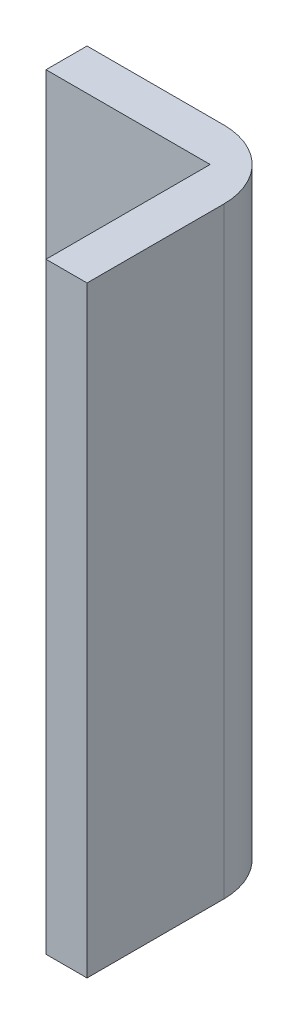
ISO-10303-21;
HEADER;
FILE_DESCRIPTION(('STEP AP214'),'2;1');
FILE_NAME('part.step','',(''),(''),'','','');
FILE_SCHEMA(('AUTOMOTIVE_DESIGN { 1 0 10303 214 1 1 1 1 }'));
ENDSEC;
DATA;
#1=APPLICATION_CONTEXT('core data for automotive mechanical design processes');
#2=APPLICATION_PROTOCOL_DEFINITION('international standard','automotive_design',2000,#1);
#3=PRODUCT_CONTEXT('',#1,'mechanical');
#4=PRODUCT('Part','Part','',(#3));
#5=PRODUCT_RELATED_PRODUCT_CATEGORY('part','',(#4));
#6=PRODUCT_DEFINITION_FORMATION('','',#4);
#7=PRODUCT_DEFINITION_CONTEXT('part definition',#1,'design');
#8=PRODUCT_DEFINITION('design','',#6,#7);
#9=PRODUCT_DEFINITION_SHAPE('','',#8);
#10=(LENGTH_UNIT() NAMED_UNIT(*) SI_UNIT(.MILLI.,.METRE.));
#11=(NAMED_UNIT(*) PLANE_ANGLE_UNIT() SI_UNIT($,.RADIAN.));
#12=(NAMED_UNIT(*) SI_UNIT($,.STERADIAN.) SOLID_ANGLE_UNIT());
#13=UNCERTAINTY_MEASURE_WITH_UNIT(LENGTH_MEASURE(1.E-05),#10,'distance_accuracy_value','');
#14=(GEOMETRIC_REPRESENTATION_CONTEXT(3) GLOBAL_UNCERTAINTY_ASSIGNED_CONTEXT((#13)) GLOBAL_UNIT_ASSIGNED_CONTEXT((#10,
#11,#12)) REPRESENTATION_CONTEXT('',''));
#15=CARTESIAN_POINT('',(0.,0.,0.));
#16=DIRECTION('',(0.,0.,1.));
#17=DIRECTION('',(1.,0.,0.));
#18=AXIS2_PLACEMENT_3D('',#15,#16,#17);
#19=CARTESIAN_POINT('',(64.6371308016878,-0.0100000000000031,-32.8481012658228));
#20=DIRECTION('',(0.,0.,-1.));
#21=DIRECTION('',(-1.,0.,0.));
#22=AXIS2_PLACEMENT_3D('',#19,#20,#21);
#23=PLANE('',#22);
#24=DIRECTION('',(1.,0.,0.));
#25=VECTOR('',#24,1.);
#26=CARTESIAN_POINT('',(0.,3.,-32.8481012658228));
#27=LINE('',#26,#25);
#28=CARTESIAN_POINT('',(64.6371308016878,3.,-32.8481012658228));
#29=VERTEX_POINT('',#28);
#30=CARTESIAN_POINT('',(67.6371308016878,3.,-32.8481012658228));
#31=VERTEX_POINT('',#30);
#32=EDGE_CURVE('E107',#29,#31,#27,.T.);
#33=ORIENTED_EDGE('',*,*,#32,.T.);
#34=DIRECTION('',(0.,-1.,0.));
#35=VECTOR('',#34,1.);
#36=CARTESIAN_POINT('',(67.6371308016878,50.,-32.8481012658228));
#37=LINE('',#36,#35);
#38=CARTESIAN_POINT('',(67.6371308016878,47.,-32.8481012658228));
#39=VERTEX_POINT('',#38);
#40=EDGE_CURVE('E115',#39,#31,#37,.T.);
#41=ORIENTED_EDGE('',*,*,#40,.F.);
#42=DIRECTION('',(-1.,0.,0.));
#43=VECTOR('',#42,1.);
#44=CARTESIAN_POINT('',(0.,47.,-32.8481012658228));
#45=LINE('',#44,#43);
#46=CARTESIAN_POINT('',(64.6371308016878,47.,-32.8481012658228));
#47=VERTEX_POINT('',#46);
#48=EDGE_CURVE('E124',#39,#47,#45,.T.);
#49=ORIENTED_EDGE('',*,*,#48,.T.);
#50=DIRECTION('',(0.,-1.,0.));
#51=VECTOR('',#50,1.);
#52=CARTESIAN_POINT('',(64.6371308016878,47.,-32.8481012658228));
#53=LINE('',#52,#51);
#54=EDGE_CURVE('E102',#47,#29,#53,.T.);
#55=ORIENTED_EDGE('',*,*,#54,.T.);
#56=EDGE_LOOP('',(#33,#41,#49,#55));
#57=FACE_BOUND('',#56,.T.);
#58=ADVANCED_FACE('F32',(#57),#23,.F.);
#59=CARTESIAN_POINT('',(52.6371308016878,-0.0100000000000031,-44.8481012658228));
#60=DIRECTION('',(1.,0.,0.));
#61=DIRECTION('',(0.,0.,-1.));
#62=AXIS2_PLACEMENT_3D('',#59,#60,#61);
#63=PLANE('',#62);
#64=DIRECTION('',(0.,0.,1.));
#65=VECTOR('',#64,1.);
#66=CARTESIAN_POINT('',(52.6371308016878,3.,0.));
#67=LINE('',#66,#65);
#68=CARTESIAN_POINT('',(52.6371308016878,3.,-47.8481012658228));
#69=VERTEX_POINT('',#68);
#70=CARTESIAN_POINT('',(52.6371308016878,3.,-44.8481012658228));
#71=VERTEX_POINT('',#70);
#72=EDGE_CURVE('E104',#69,#71,#67,.T.);
#73=ORIENTED_EDGE('',*,*,#72,.T.);
#74=DIRECTION('',(0.,1.,0.));
#75=VECTOR('',#74,1.);
#76=CARTESIAN_POINT('',(52.6371308016878,-0.0100000000000031,-44.8481012658228));
#77=LINE('',#76,#75);
#78=CARTESIAN_POINT('',(52.6371308016878,47.,-44.8481012658228));
#79=VERTEX_POINT('',#78);
#80=EDGE_CURVE('E94',#71,#79,#77,.T.);
#81=ORIENTED_EDGE('',*,*,#80,.T.);
#82=DIRECTION('',(0.,0.,-1.));
#83=VECTOR('',#82,1.);
#84=CARTESIAN_POINT('',(52.6371308016878,47.,0.));
#85=LINE('',#84,#83);
#86=CARTESIAN_POINT('',(52.6371308016878,47.,-47.8481012658228));
#87=VERTEX_POINT('',#86);
#88=EDGE_CURVE('E122',#79,#87,#85,.T.);
#89=ORIENTED_EDGE('',*,*,#88,.T.);
#90=DIRECTION('',(0.,1.,0.));
#91=VECTOR('',#90,1.);
#92=CARTESIAN_POINT('',(52.6371308016878,-0.0100000000000031,-47.8481012658228));
#93=LINE('',#92,#91);
#94=EDGE_CURVE('E106',#69,#87,#93,.T.);
#95=ORIENTED_EDGE('',*,*,#94,.F.);
#96=EDGE_LOOP('',(#73,#81,#89,#95));
#97=FACE_BOUND('',#96,.T.);
#98=ADVANCED_FACE('F105',(#97),#63,.F.);
#99=CARTESIAN_POINT('',(64.6371308016878,47.,-47.8481012658228));
#100=DIRECTION('',(-1.,0.,0.));
#101=DIRECTION('',(0.,0.,1.));
#102=AXIS2_PLACEMENT_3D('',#99,#100,#101);
#103=PLANE('',#102);
#104=ORIENTED_EDGE('',*,*,#54,.F.);
#105=DIRECTION('',(0.,0.,-1.));
#106=VECTOR('',#105,1.);
#107=CARTESIAN_POINT('',(64.6371308016878,47.,-47.8481012658228));
#108=LINE('',#107,#106);
#109=CARTESIAN_POINT('',(64.6371308016878,47.,-44.8481012658228));
#110=VERTEX_POINT('',#109);
#111=EDGE_CURVE('E36',#47,#110,#108,.T.);
#112=ORIENTED_EDGE('',*,*,#111,.T.);
#113=DIRECTION('',(0.,-1.,0.));
#114=VECTOR('',#113,1.);
#115=CARTESIAN_POINT('',(64.6371308016878,47.,-44.8481012658228));
#116=LINE('',#115,#114);
#117=CARTESIAN_POINT('',(64.6371308016878,3.,-44.8481012658228));
#118=VERTEX_POINT('',#117);
#119=EDGE_CURVE('E120',#110,#118,#116,.T.);
#120=ORIENTED_EDGE('',*,*,#119,.T.);
#121=DIRECTION('',(0.,0.,-1.));
#122=VECTOR('',#121,1.);
#123=CARTESIAN_POINT('',(64.6371308016878,3.,-47.8481012658228));
#124=LINE('',#123,#122);
#125=EDGE_CURVE('E11',#29,#118,#124,.T.);
#126=ORIENTED_EDGE('',*,*,#125,.F.);
#127=EDGE_LOOP('',(#104,#112,#120,#126));
#128=FACE_BOUND('',#127,.T.);
#129=ADVANCED_FACE('F160',(#128),#103,.T.);
#130=CARTESIAN_POINT('',(62.6371308016877,50.,-42.8481012658228));
#131=DIRECTION('',(0.,-1.,0.));
#132=DIRECTION('',(0.,0.,-1.));
#133=AXIS2_PLACEMENT_3D('',#130,#131,#132);
#134=CYLINDRICAL_SURFACE('',#133,5.);
#135=DIRECTION('',(0.,-1.,0.));
#136=VECTOR('',#135,1.);
#137=CARTESIAN_POINT('',(62.6371308016877,50.,-47.8481012658228));
#138=LINE('',#137,#136);
#139=CARTESIAN_POINT('',(62.6371308016877,47.,-47.8481012658228));
#140=VERTEX_POINT('',#139);
#141=CARTESIAN_POINT('',(62.6371308016877,3.,-47.8481012658228));
#142=VERTEX_POINT('',#141);
#143=EDGE_CURVE('E142',#140,#142,#138,.T.);
#144=ORIENTED_EDGE('',*,*,#143,.F.);
#145=CARTESIAN_POINT('',(62.6371308016877,47.,-42.8481012658228));
#146=DIRECTION('',(0.,1.,0.));
#147=DIRECTION('',(0.,0.,1.));
#148=AXIS2_PLACEMENT_3D('',#145,#146,#147);
#149=CIRCLE('',#148,5.);
#150=CARTESIAN_POINT('',(67.6371308016878,47.,-42.8481012658228));
#151=VERTEX_POINT('',#150);
#152=EDGE_CURVE('E126',#140,#151,#149,.F.);
#153=ORIENTED_EDGE('',*,*,#152,.T.);
#154=DIRECTION('',(0.,-1.,0.));
#155=VECTOR('',#154,1.);
#156=CARTESIAN_POINT('',(67.6371308016878,50.,-42.8481012658228));
#157=LINE('',#156,#155);
#158=CARTESIAN_POINT('',(67.6371308016878,3.,-42.8481012658228));
#159=VERTEX_POINT('',#158);
#160=EDGE_CURVE('E138',#159,#151,#157,.F.);
#161=ORIENTED_EDGE('',*,*,#160,.F.);
#162=CARTESIAN_POINT('',(62.6371308016877,3.,-42.8481012658228));
#163=DIRECTION('',(0.,-1.,0.));
#164=DIRECTION('',(0.,0.,-1.));
#165=AXIS2_PLACEMENT_3D('',#162,#163,#164);
#166=CIRCLE('',#165,5.);
#167=EDGE_CURVE('E132',#159,#142,#166,.F.);
#168=ORIENTED_EDGE('',*,*,#167,.T.);
#169=EDGE_LOOP('',(#144,#153,#161,#168));
#170=FACE_BOUND('',#169,.T.);
#171=ADVANCED_FACE('F155',(#170),#134,.T.);
#172=CARTESIAN_POINT('',(0.,47.,0.));
#173=DIRECTION('',(0.,1.,0.));
#174=DIRECTION('',(0.,0.,1.));
#175=AXIS2_PLACEMENT_3D('',#172,#173,#174);
#176=PLANE('',#175);
#177=ORIENTED_EDGE('',*,*,#48,.F.);
#178=DIRECTION('',(0.,0.,-1.));
#179=VECTOR('',#178,1.);
#180=CARTESIAN_POINT('',(67.6371308016878,47.,-47.8481012658228));
#181=LINE('',#180,#179);
#182=EDGE_CURVE('E125',#39,#151,#181,.T.);
#183=ORIENTED_EDGE('',*,*,#182,.T.);
#184=ORIENTED_EDGE('',*,*,#152,.F.);
#185=DIRECTION('',(-1.,0.,0.));
#186=VECTOR('',#185,1.);
#187=CARTESIAN_POINT('',(-98.3544303797468,47.,-47.8481012658228));
#188=LINE('',#187,#186);
#189=EDGE_CURVE('E111',#140,#87,#188,.T.);
#190=ORIENTED_EDGE('',*,*,#189,.T.);
#191=ORIENTED_EDGE('',*,*,#88,.F.);
#192=DIRECTION('',(-1.,0.,0.));
#193=VECTOR('',#192,1.);
#194=CARTESIAN_POINT('',(-98.3544303797468,47.,-44.8481012658228));
#195=LINE('',#194,#193);
#196=EDGE_CURVE('E99',#110,#79,#195,.T.);
#197=ORIENTED_EDGE('',*,*,#196,.F.);
#198=ORIENTED_EDGE('',*,*,#111,.F.);
#199=EDGE_LOOP('',(#177,#183,#184,#190,#191,#197,#198));
#200=FACE_BOUND('',#199,.T.);
#201=ADVANCED_FACE('F158',(#200),#176,.T.);
#202=CARTESIAN_POINT('',(0.,3.,0.));
#203=DIRECTION('',(0.,-1.,0.));
#204=DIRECTION('',(0.,0.,-1.));
#205=AXIS2_PLACEMENT_3D('',#202,#203,#204);
#206=PLANE('',#205);
#207=ORIENTED_EDGE('',*,*,#32,.F.);
#208=ORIENTED_EDGE('',*,*,#125,.T.);
#209=DIRECTION('',(-1.,0.,0.));
#210=VECTOR('',#209,1.);
#211=CARTESIAN_POINT('',(-98.3544303797468,3.,-44.8481012658228));
#212=LINE('',#211,#210);
#213=EDGE_CURVE('E41',#118,#71,#212,.T.);
#214=ORIENTED_EDGE('',*,*,#213,.T.);
#215=ORIENTED_EDGE('',*,*,#72,.F.);
#216=DIRECTION('',(1.,0.,0.));
#217=VECTOR('',#216,1.);
#218=CARTESIAN_POINT('',(-98.3544303797468,3.,-47.8481012658228));
#219=LINE('',#218,#217);
#220=EDGE_CURVE('E54',#69,#142,#219,.T.);
#221=ORIENTED_EDGE('',*,*,#220,.T.);
#222=ORIENTED_EDGE('',*,*,#167,.F.);
#223=DIRECTION('',(0.,0.,1.));
#224=VECTOR('',#223,1.);
#225=CARTESIAN_POINT('',(67.6371308016878,3.,-47.8481012658228));
#226=LINE('',#225,#224);
#227=EDGE_CURVE('E119',#159,#31,#226,.T.);
#228=ORIENTED_EDGE('',*,*,#227,.T.);
#229=EDGE_LOOP('',(#207,#208,#214,#215,#221,#222,#228));
#230=FACE_BOUND('',#229,.T.);
#231=ADVANCED_FACE('F109',(#230),#206,.T.);
#232=CARTESIAN_POINT('',(-98.3544303797468,50.,-47.8481012658228));
#233=DIRECTION('',(0.,0.,1.));
#234=DIRECTION('',(1.,0.,0.));
#235=AXIS2_PLACEMENT_3D('',#232,#233,#234);
#236=PLANE('',#235);
#237=ORIENTED_EDGE('',*,*,#220,.F.);
#238=ORIENTED_EDGE('',*,*,#94,.T.);
#239=ORIENTED_EDGE('',*,*,#189,.F.);
#240=ORIENTED_EDGE('',*,*,#143,.T.);
#241=EDGE_LOOP('',(#237,#238,#239,#240));
#242=FACE_BOUND('',#241,.T.);
#243=ADVANCED_FACE('F34',(#242),#236,.F.);
#244=CARTESIAN_POINT('',(67.6371308016878,50.,-47.8481012658228));
#245=DIRECTION('',(-1.,0.,0.));
#246=DIRECTION('',(0.,0.,1.));
#247=AXIS2_PLACEMENT_3D('',#244,#245,#246);
#248=PLANE('',#247);
#249=ORIENTED_EDGE('',*,*,#182,.F.);
#250=ORIENTED_EDGE('',*,*,#40,.T.);
#251=ORIENTED_EDGE('',*,*,#227,.F.);
#252=ORIENTED_EDGE('',*,*,#160,.T.);
#253=EDGE_LOOP('',(#249,#250,#251,#252));
#254=FACE_BOUND('',#253,.T.);
#255=ADVANCED_FACE('F154',(#254),#248,.F.);
#256=CARTESIAN_POINT('',(-98.3544303797468,47.,-44.8481012658228));
#257=DIRECTION('',(0.,0.,1.));
#258=DIRECTION('',(1.,0.,0.));
#259=AXIS2_PLACEMENT_3D('',#256,#257,#258);
#260=PLANE('',#259);
#261=ORIENTED_EDGE('',*,*,#80,.F.);
#262=ORIENTED_EDGE('',*,*,#213,.F.);
#263=ORIENTED_EDGE('',*,*,#119,.F.);
#264=ORIENTED_EDGE('',*,*,#196,.T.);
#265=EDGE_LOOP('',(#261,#262,#263,#264));
#266=FACE_BOUND('',#265,.T.);
#267=ADVANCED_FACE('F96',(#266),#260,.T.);
#268=CLOSED_SHELL('',(#58,#98,#129,#171,#201,#231,#243,#255,#267));
#269=MANIFOLD_SOLID_BREP('B2',#268);
#270=ADVANCED_BREP_SHAPE_REPRESENTATION('',(#18,#269),#14);
#271=SHAPE_DEFINITION_REPRESENTATION(#9,#270);
ENDSEC;
END-ISO-10303-21;
